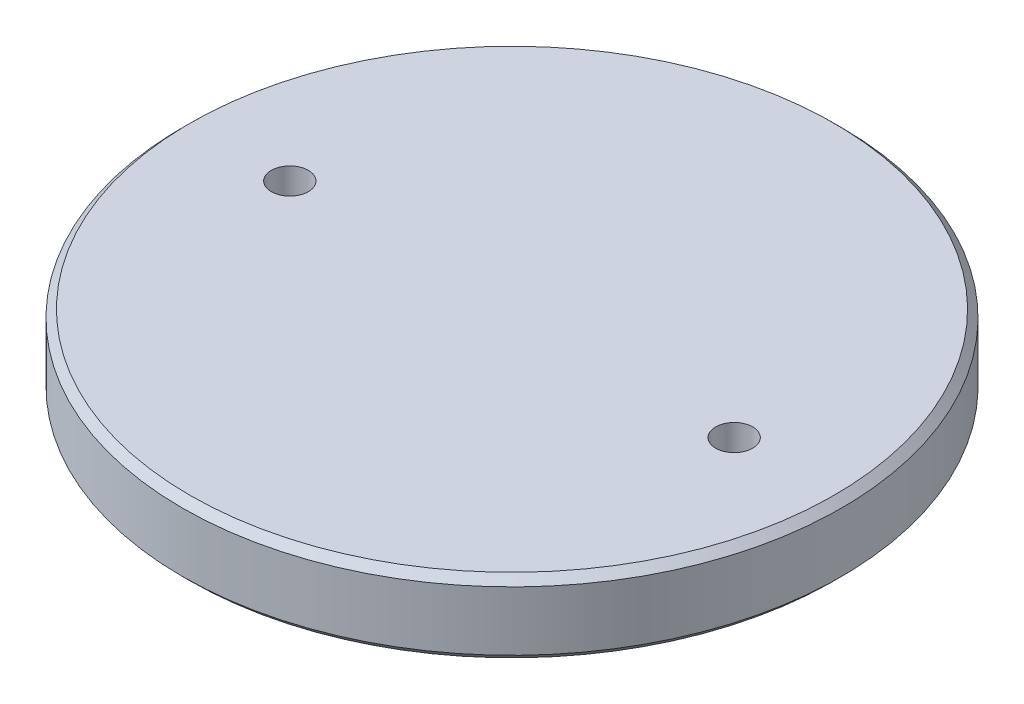
ISO-10303-21;
HEADER;
FILE_DESCRIPTION(('STEP AP214'),'2;1');
FILE_NAME('part.step','',(''),(''),'','','');
FILE_SCHEMA(('AUTOMOTIVE_DESIGN { 1 0 10303 214 1 1 1 1 }'));
ENDSEC;
DATA;
#1=APPLICATION_CONTEXT('core data for automotive mechanical design processes');
#2=APPLICATION_PROTOCOL_DEFINITION('international standard','automotive_design',2000,#1);
#3=PRODUCT_CONTEXT('',#1,'mechanical');
#4=PRODUCT('Part','Part','',(#3));
#5=PRODUCT_RELATED_PRODUCT_CATEGORY('part','',(#4));
#6=PRODUCT_DEFINITION_FORMATION('','',#4);
#7=PRODUCT_DEFINITION_CONTEXT('part definition',#1,'design');
#8=PRODUCT_DEFINITION('design','',#6,#7);
#9=PRODUCT_DEFINITION_SHAPE('','',#8);
#10=(LENGTH_UNIT() NAMED_UNIT(*) SI_UNIT(.MILLI.,.METRE.));
#11=(NAMED_UNIT(*) PLANE_ANGLE_UNIT() SI_UNIT($,.RADIAN.));
#12=(NAMED_UNIT(*) SI_UNIT($,.STERADIAN.) SOLID_ANGLE_UNIT());
#13=UNCERTAINTY_MEASURE_WITH_UNIT(LENGTH_MEASURE(1.E-05),#10,'distance_accuracy_value','');
#14=(GEOMETRIC_REPRESENTATION_CONTEXT(3) GLOBAL_UNCERTAINTY_ASSIGNED_CONTEXT((#13)) GLOBAL_UNIT_ASSIGNED_CONTEXT((#10,
#11,#12)) REPRESENTATION_CONTEXT('',''));
#15=CARTESIAN_POINT('',(0.,0.,0.));
#16=DIRECTION('',(0.,0.,1.));
#17=DIRECTION('',(1.,0.,0.));
#18=AXIS2_PLACEMENT_3D('',#15,#16,#17);
#19=CARTESIAN_POINT('',(0.,12.7,0.));
#20=DIRECTION('',(0.,-1.,0.));
#21=DIRECTION('',(0.,0.,-1.));
#22=AXIS2_PLACEMENT_3D('',#19,#20,#21);
#23=CYLINDRICAL_SURFACE('',#22,56.515);
#24=CARTESIAN_POINT('',(0.,1.26999999999999,0.));
#25=DIRECTION('',(0.,1.,0.));
#26=DIRECTION('',(0.,0.,1.));
#27=AXIS2_PLACEMENT_3D('',#24,#25,#26);
#28=CIRCLE('',#27,56.515);
#29=CARTESIAN_POINT('',(0.,1.26999999999999,56.515));
#30=VERTEX_POINT('',#29);
#31=EDGE_CURVE('E72',#30,#30,#28,.T.);
#32=ORIENTED_EDGE('',*,*,#31,.T.);
#33=EDGE_LOOP('',(#32));
#34=FACE_BOUND('',#33,.T.);
#35=CARTESIAN_POINT('',(0.,11.43,0.));
#36=DIRECTION('',(0.,1.,0.));
#37=DIRECTION('',(0.,0.,1.));
#38=AXIS2_PLACEMENT_3D('',#35,#36,#37);
#39=CIRCLE('',#38,56.515);
#40=CARTESIAN_POINT('',(0.,11.43,56.515));
#41=VERTEX_POINT('',#40);
#42=EDGE_CURVE('E76',#41,#41,#39,.F.);
#43=ORIENTED_EDGE('',*,*,#42,.T.);
#44=EDGE_LOOP('',(#43));
#45=FACE_BOUND('',#44,.T.);
#46=ADVANCED_FACE('F43',(#34,#45),#23,.T.);
#47=CARTESIAN_POINT('',(0.,12.7,0.));
#48=DIRECTION('',(0.,1.,0.));
#49=DIRECTION('',(0.,0.,1.));
#50=AXIS2_PLACEMENT_3D('',#47,#48,#49);
#51=PLANE('',#50);
#52=CARTESIAN_POINT('',(-38.1,12.7,0.));
#53=DIRECTION('',(0.,1.,0.));
#54=DIRECTION('',(0.,0.,1.));
#55=AXIS2_PLACEMENT_3D('',#52,#53,#54);
#56=CIRCLE('',#55,3.175);
#57=CARTESIAN_POINT('',(-38.1,12.7,3.175));
#58=VERTEX_POINT('',#57);
#59=EDGE_CURVE('E89',#58,#58,#56,.T.);
#60=ORIENTED_EDGE('',*,*,#59,.F.);
#61=EDGE_LOOP('',(#60));
#62=FACE_BOUND('',#61,.T.);
#63=CARTESIAN_POINT('',(38.1,12.7,0.));
#64=DIRECTION('',(0.,1.,0.));
#65=DIRECTION('',(0.,0.,1.));
#66=AXIS2_PLACEMENT_3D('',#63,#64,#65);
#67=CIRCLE('',#66,3.175);
#68=CARTESIAN_POINT('',(38.1,12.7,3.17500000000001));
#69=VERTEX_POINT('',#68);
#70=EDGE_CURVE('E85',#69,#69,#67,.T.);
#71=ORIENTED_EDGE('',*,*,#70,.F.);
#72=EDGE_LOOP('',(#71));
#73=FACE_BOUND('',#72,.T.);
#74=CARTESIAN_POINT('',(0.,12.7,0.));
#75=DIRECTION('',(0.,1.,0.));
#76=DIRECTION('',(0.,0.,1.));
#77=AXIS2_PLACEMENT_3D('',#74,#75,#76);
#78=CIRCLE('',#77,55.245);
#79=CARTESIAN_POINT('',(0.,12.7,55.245));
#80=VERTEX_POINT('',#79);
#81=EDGE_CURVE('E62',#80,#80,#78,.T.);
#82=ORIENTED_EDGE('',*,*,#81,.T.);
#83=EDGE_LOOP('',(#82));
#84=FACE_BOUND('',#83,.T.);
#85=ADVANCED_FACE('F107',(#62,#73,#84),#51,.T.);
#86=CARTESIAN_POINT('',(0.,0.,0.));
#87=DIRECTION('',(0.,1.,0.));
#88=DIRECTION('',(0.,0.,1.));
#89=AXIS2_PLACEMENT_3D('',#86,#87,#88);
#90=PLANE('',#89);
#91=CARTESIAN_POINT('',(0.,0.,0.));
#92=DIRECTION('',(0.,-1.,0.));
#93=DIRECTION('',(0.,0.,-1.));
#94=AXIS2_PLACEMENT_3D('',#91,#92,#93);
#95=CIRCLE('',#94,50.165);
#96=CARTESIAN_POINT('',(0.,0.,-50.165));
#97=VERTEX_POINT('',#96);
#98=EDGE_CURVE('E57',#97,#97,#95,.T.);
#99=ORIENTED_EDGE('',*,*,#98,.F.);
#100=EDGE_LOOP('',(#99));
#101=FACE_BOUND('',#100,.T.);
#102=CARTESIAN_POINT('',(0.,0.,0.));
#103=DIRECTION('',(0.,1.,0.));
#104=DIRECTION('',(0.,0.,1.));
#105=AXIS2_PLACEMENT_3D('',#102,#103,#104);
#106=CIRCLE('',#105,55.245);
#107=CARTESIAN_POINT('',(0.,0.,55.245));
#108=VERTEX_POINT('',#107);
#109=EDGE_CURVE('E68',#108,#108,#106,.F.);
#110=ORIENTED_EDGE('',*,*,#109,.T.);
#111=EDGE_LOOP('',(#110));
#112=FACE_BOUND('',#111,.T.);
#113=ADVANCED_FACE('F110',(#101,#112),#90,.F.);
#114=CARTESIAN_POINT('',(0.,1.26999999999999,0.));
#115=DIRECTION('',(0.,1.,0.));
#116=DIRECTION('',(0.,0.,1.));
#117=AXIS2_PLACEMENT_3D('',#114,#115,#116);
#118=CONICAL_SURFACE('',#117,56.515,0.785398163397451);
#119=ORIENTED_EDGE('',*,*,#109,.F.);
#120=EDGE_LOOP('',(#119));
#121=FACE_BOUND('',#120,.T.);
#122=ORIENTED_EDGE('',*,*,#31,.F.);
#123=EDGE_LOOP('',(#122));
#124=FACE_BOUND('',#123,.T.);
#125=ADVANCED_FACE('F119',(#121,#124),#118,.T.);
#126=CARTESIAN_POINT('',(0.,12.7,0.));
#127=DIRECTION('',(0.,-1.,0.));
#128=DIRECTION('',(0.,0.,-1.));
#129=AXIS2_PLACEMENT_3D('',#126,#127,#128);
#130=CONICAL_SURFACE('',#129,55.245,0.785398163397443);
#131=ORIENTED_EDGE('',*,*,#42,.F.);
#132=EDGE_LOOP('',(#131));
#133=FACE_BOUND('',#132,.T.);
#134=ORIENTED_EDGE('',*,*,#81,.F.);
#135=EDGE_LOOP('',(#134));
#136=FACE_BOUND('',#135,.T.);
#137=ADVANCED_FACE('F116',(#133,#136),#130,.T.);
#138=CARTESIAN_POINT('',(0.,-3.175,0.));
#139=DIRECTION('',(0.,1.,0.));
#140=DIRECTION('',(0.,0.,1.));
#141=AXIS2_PLACEMENT_3D('',#138,#139,#140);
#142=CYLINDRICAL_SURFACE('',#141,50.165);
#143=CARTESIAN_POINT('',(0.,-1.90499999999999,0.));
#144=DIRECTION('',(0.,-1.,0.));
#145=DIRECTION('',(0.,0.,-1.));
#146=AXIS2_PLACEMENT_3D('',#143,#144,#145);
#147=CIRCLE('',#146,50.165);
#148=CARTESIAN_POINT('',(0.,-1.90499999999999,-50.165));
#149=VERTEX_POINT('',#148);
#150=EDGE_CURVE('E10',#149,#149,#147,.F.);
#151=ORIENTED_EDGE('',*,*,#150,.T.);
#152=EDGE_LOOP('',(#151));
#153=FACE_BOUND('',#152,.T.);
#154=ORIENTED_EDGE('',*,*,#98,.T.);
#155=EDGE_LOOP('',(#154));
#156=FACE_BOUND('',#155,.T.);
#157=ADVANCED_FACE('F118',(#153,#156),#142,.T.);
#158=CARTESIAN_POINT('',(0.,-3.175,0.));
#159=DIRECTION('',(0.,-1.,0.));
#160=DIRECTION('',(0.,0.,-1.));
#161=AXIS2_PLACEMENT_3D('',#158,#159,#160);
#162=PLANE('',#161);
#163=CARTESIAN_POINT('',(-38.1,-3.175,0.));
#164=DIRECTION('',(0.,1.,0.));
#165=DIRECTION('',(0.,0.,1.));
#166=AXIS2_PLACEMENT_3D('',#163,#164,#165);
#167=CIRCLE('',#166,3.175);
#168=CARTESIAN_POINT('',(-38.1,-3.175,3.175));
#169=VERTEX_POINT('',#168);
#170=EDGE_CURVE('E79',#169,#169,#167,.T.);
#171=ORIENTED_EDGE('',*,*,#170,.T.);
#172=EDGE_LOOP('',(#171));
#173=FACE_BOUND('',#172,.T.);
#174=CARTESIAN_POINT('',(38.1,-3.175,0.));
#175=DIRECTION('',(0.,1.,0.));
#176=DIRECTION('',(0.,0.,1.));
#177=AXIS2_PLACEMENT_3D('',#174,#175,#176);
#178=CIRCLE('',#177,3.175);
#179=CARTESIAN_POINT('',(38.1,-3.175,3.17500000000001));
#180=VERTEX_POINT('',#179);
#181=EDGE_CURVE('E81',#180,#180,#178,.T.);
#182=ORIENTED_EDGE('',*,*,#181,.T.);
#183=EDGE_LOOP('',(#182));
#184=FACE_BOUND('',#183,.T.);
#185=CARTESIAN_POINT('',(0.,-3.175,0.));
#186=DIRECTION('',(0.,-1.,0.));
#187=DIRECTION('',(0.,0.,-1.));
#188=AXIS2_PLACEMENT_3D('',#185,#186,#187);
#189=CIRCLE('',#188,48.895);
#190=CARTESIAN_POINT('',(0.,-3.175,-48.895));
#191=VERTEX_POINT('',#190);
#192=EDGE_CURVE('E52',#191,#191,#189,.T.);
#193=ORIENTED_EDGE('',*,*,#192,.T.);
#194=EDGE_LOOP('',(#193));
#195=FACE_BOUND('',#194,.T.);
#196=ADVANCED_FACE('F97',(#173,#184,#195),#162,.T.);
#197=CARTESIAN_POINT('',(0.,-3.175,0.));
#198=DIRECTION('',(0.,1.,0.));
#199=DIRECTION('',(0.,0.,1.));
#200=AXIS2_PLACEMENT_3D('',#197,#198,#199);
#201=CONICAL_SURFACE('',#200,48.895,0.78539816339744);
#202=ORIENTED_EDGE('',*,*,#150,.F.);
#203=EDGE_LOOP('',(#202));
#204=FACE_BOUND('',#203,.T.);
#205=ORIENTED_EDGE('',*,*,#192,.F.);
#206=EDGE_LOOP('',(#205));
#207=FACE_BOUND('',#206,.T.);
#208=ADVANCED_FACE('F46',(#204,#207),#201,.T.);
#209=CARTESIAN_POINT('',(38.1,-3.175,0.));
#210=DIRECTION('',(0.,1.,0.));
#211=DIRECTION('',(0.,0.,1.));
#212=AXIS2_PLACEMENT_3D('',#209,#210,#211);
#213=CYLINDRICAL_SURFACE('',#212,3.175);
#214=ORIENTED_EDGE('',*,*,#181,.F.);
#215=EDGE_LOOP('',(#214));
#216=FACE_BOUND('',#215,.T.);
#217=ORIENTED_EDGE('',*,*,#70,.T.);
#218=EDGE_LOOP('',(#217));
#219=FACE_BOUND('',#218,.T.);
#220=ADVANCED_FACE('F103',(#216,#219),#213,.F.);
#221=CARTESIAN_POINT('',(-38.1,-3.175,0.));
#222=DIRECTION('',(0.,1.,0.));
#223=DIRECTION('',(0.,0.,1.));
#224=AXIS2_PLACEMENT_3D('',#221,#222,#223);
#225=CYLINDRICAL_SURFACE('',#224,3.175);
#226=ORIENTED_EDGE('',*,*,#170,.F.);
#227=EDGE_LOOP('',(#226));
#228=FACE_BOUND('',#227,.T.);
#229=ORIENTED_EDGE('',*,*,#59,.T.);
#230=EDGE_LOOP('',(#229));
#231=FACE_BOUND('',#230,.T.);
#232=ADVANCED_FACE('F100',(#228,#231),#225,.F.);
#233=CLOSED_SHELL('',(#46,#85,#113,#125,#137,#157,#196,#208,#220,#232));
#234=MANIFOLD_SOLID_BREP('B2',#233);
#235=ADVANCED_BREP_SHAPE_REPRESENTATION('',(#18,#234),#14);
#236=SHAPE_DEFINITION_REPRESENTATION(#9,#235);
ENDSEC;
END-ISO-10303-21;
